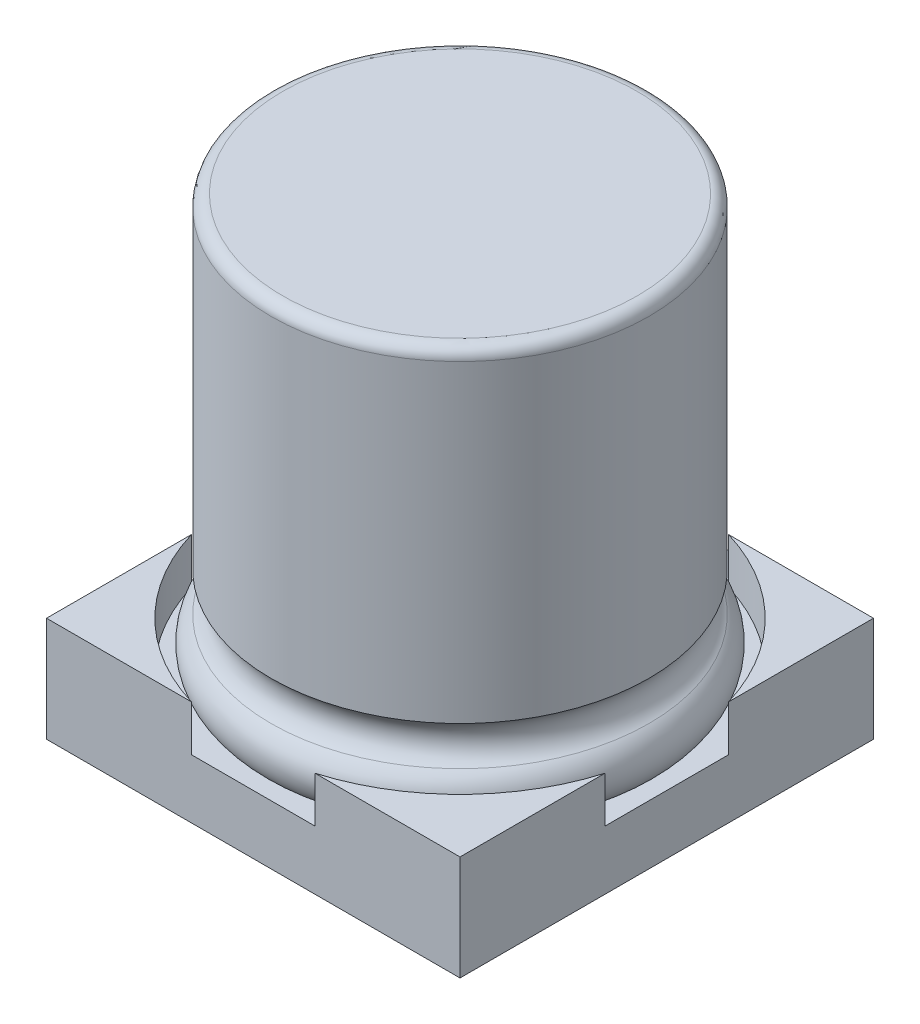
ISO-10303-21;
HEADER;
FILE_DESCRIPTION(('STEP AP214'),'2;1');
FILE_NAME('part.step','',(''),(''),'','','');
FILE_SCHEMA(('AUTOMOTIVE_DESIGN { 1 0 10303 214 1 1 1 1 }'));
ENDSEC;
DATA;
#1=APPLICATION_CONTEXT('core data for automotive mechanical design processes');
#2=APPLICATION_PROTOCOL_DEFINITION('international standard','automotive_design',2000,#1);
#3=PRODUCT_CONTEXT('',#1,'mechanical');
#4=PRODUCT('Part','Part','',(#3));
#5=PRODUCT_RELATED_PRODUCT_CATEGORY('part','',(#4));
#6=PRODUCT_DEFINITION_FORMATION('','',#4);
#7=PRODUCT_DEFINITION_CONTEXT('part definition',#1,'design');
#8=PRODUCT_DEFINITION('design','',#6,#7);
#9=PRODUCT_DEFINITION_SHAPE('','',#8);
#10=(LENGTH_UNIT() NAMED_UNIT(*) SI_UNIT(.MILLI.,.METRE.));
#11=(NAMED_UNIT(*) PLANE_ANGLE_UNIT() SI_UNIT($,.RADIAN.));
#12=(NAMED_UNIT(*) SI_UNIT($,.STERADIAN.) SOLID_ANGLE_UNIT());
#13=UNCERTAINTY_MEASURE_WITH_UNIT(LENGTH_MEASURE(1.E-05),#10,'distance_accuracy_value','');
#14=(GEOMETRIC_REPRESENTATION_CONTEXT(3) GLOBAL_UNCERTAINTY_ASSIGNED_CONTEXT((#13)) GLOBAL_UNIT_ASSIGNED_CONTEXT((#10,
#11,#12)) REPRESENTATION_CONTEXT('',''));
#15=CARTESIAN_POINT('',(0.,0.,0.));
#16=DIRECTION('',(0.,0.,1.));
#17=DIRECTION('',(1.,0.,0.));
#18=AXIS2_PLACEMENT_3D('',#15,#16,#17);
#19=CARTESIAN_POINT('',(0.,0.2,-4.6380085368));
#20=DIRECTION('',(0.,0.,-1.));
#21=DIRECTION('',(-1.,0.,0.));
#22=AXIS2_PLACEMENT_3D('',#19,#20,#21);
#23=PLANE('',#22);
#24=DIRECTION('',(1.,0.,0.));
#25=VECTOR('',#24,1.);
#26=CARTESIAN_POINT('',(-0.6,0.4,-4.6380085368));
#27=LINE('',#26,#25);
#28=CARTESIAN_POINT('',(0.6,0.4,-4.6380085368));
#29=VERTEX_POINT('',#28);
#30=CARTESIAN_POINT('',(-0.6,0.4,-4.6380085368));
#31=VERTEX_POINT('',#30);
#32=EDGE_CURVE('E129',#29,#31,#27,.F.);
#33=ORIENTED_EDGE('',*,*,#32,.F.);
#34=DIRECTION('',(0.,1.,0.));
#35=VECTOR('',#34,1.);
#36=CARTESIAN_POINT('',(0.6,0.4,-4.6380085368));
#37=LINE('',#36,#35);
#38=CARTESIAN_POINT('',(0.6,0.,-4.6380085368));
#39=VERTEX_POINT('',#38);
#40=EDGE_CURVE('E136',#39,#29,#37,.T.);
#41=ORIENTED_EDGE('',*,*,#40,.F.);
#42=DIRECTION('',(1.,0.,0.));
#43=VECTOR('',#42,1.);
#44=CARTESIAN_POINT('',(0.,0.,-4.6380085368));
#45=LINE('',#44,#43);
#46=CARTESIAN_POINT('',(-0.6,0.,-4.6380085368));
#47=VERTEX_POINT('',#46);
#48=EDGE_CURVE('E132',#39,#47,#45,.F.);
#49=ORIENTED_EDGE('',*,*,#48,.T.);
#50=DIRECTION('',(0.,1.,0.));
#51=VECTOR('',#50,1.);
#52=CARTESIAN_POINT('',(-0.6,0.,-4.6380085368));
#53=LINE('',#52,#51);
#54=EDGE_CURVE('E126',#31,#47,#53,.F.);
#55=ORIENTED_EDGE('',*,*,#54,.F.);
#56=EDGE_LOOP('',(#33,#41,#49,#55));
#57=FACE_BOUND('',#56,.T.);
#58=ADVANCED_FACE('F17',(#57),#23,.T.);
#59=CARTESIAN_POINT('',(-0.6,0.,-3.5));
#60=DIRECTION('',(-1.,0.,0.));
#61=DIRECTION('',(0.,0.,1.));
#62=AXIS2_PLACEMENT_3D('',#59,#60,#61);
#63=PLANE('',#62);
#64=ORIENTED_EDGE('',*,*,#54,.T.);
#65=DIRECTION('',(0.,0.,1.));
#66=VECTOR('',#65,1.);
#67=CARTESIAN_POINT('',(-0.6,0.,0.));
#68=LINE('',#67,#66);
#69=CARTESIAN_POINT('',(-0.6,0.,-3.5));
#70=VERTEX_POINT('',#69);
#71=EDGE_CURVE('E210',#47,#70,#68,.T.);
#72=ORIENTED_EDGE('',*,*,#71,.T.);
#73=DIRECTION('',(0.,1.,0.));
#74=VECTOR('',#73,1.);
#75=CARTESIAN_POINT('',(-0.6,0.,-3.5));
#76=LINE('',#75,#74);
#77=CARTESIAN_POINT('',(-0.6,0.4,-3.5));
#78=VERTEX_POINT('',#77);
#79=EDGE_CURVE('E142',#78,#70,#76,.F.);
#80=ORIENTED_EDGE('',*,*,#79,.F.);
#81=DIRECTION('',(0.,0.,1.));
#82=VECTOR('',#81,1.);
#83=CARTESIAN_POINT('',(-0.6,0.4,-3.5));
#84=LINE('',#83,#82);
#85=EDGE_CURVE('E139',#31,#78,#84,.T.);
#86=ORIENTED_EDGE('',*,*,#85,.F.);
#87=EDGE_LOOP('',(#64,#72,#80,#86));
#88=FACE_BOUND('',#87,.T.);
#89=ADVANCED_FACE('F140',(#88),#63,.T.);
#90=CARTESIAN_POINT('',(0.6,0.4,-3.5));
#91=DIRECTION('',(1.,0.,0.));
#92=DIRECTION('',(0.,0.,-1.));
#93=AXIS2_PLACEMENT_3D('',#90,#91,#92);
#94=PLANE('',#93);
#95=ORIENTED_EDGE('',*,*,#40,.T.);
#96=DIRECTION('',(0.,0.,1.));
#97=VECTOR('',#96,1.);
#98=CARTESIAN_POINT('',(0.6,0.4,-3.5));
#99=LINE('',#98,#97);
#100=CARTESIAN_POINT('',(0.6,0.4,-3.5));
#101=VERTEX_POINT('',#100);
#102=EDGE_CURVE('E149',#101,#29,#99,.F.);
#103=ORIENTED_EDGE('',*,*,#102,.F.);
#104=DIRECTION('',(0.,1.,0.));
#105=VECTOR('',#104,1.);
#106=CARTESIAN_POINT('',(0.6,0.,-3.5));
#107=LINE('',#106,#105);
#108=CARTESIAN_POINT('',(0.6,0.,-3.5));
#109=VERTEX_POINT('',#108);
#110=EDGE_CURVE('E196',#109,#101,#107,.T.);
#111=ORIENTED_EDGE('',*,*,#110,.F.);
#112=DIRECTION('',(0.,0.,1.));
#113=VECTOR('',#112,1.);
#114=CARTESIAN_POINT('',(0.6,0.,0.));
#115=LINE('',#114,#113);
#116=EDGE_CURVE('E211',#109,#39,#115,.F.);
#117=ORIENTED_EDGE('',*,*,#116,.T.);
#118=EDGE_LOOP('',(#95,#103,#111,#117));
#119=FACE_BOUND('',#118,.T.);
#120=ADVANCED_FACE('F215',(#119),#94,.T.);
#121=CARTESIAN_POINT('',(-0.6,0.4,-3.5));
#122=DIRECTION('',(0.,1.,0.));
#123=DIRECTION('',(0.,0.,1.));
#124=AXIS2_PLACEMENT_3D('',#121,#122,#123);
#125=PLANE('',#124);
#126=ORIENTED_EDGE('',*,*,#32,.T.);
#127=ORIENTED_EDGE('',*,*,#85,.T.);
#128=DIRECTION('',(-1.,0.,0.));
#129=VECTOR('',#128,1.);
#130=CARTESIAN_POINT('',(3.5,0.4,-3.5));
#131=LINE('',#130,#129);
#132=EDGE_CURVE('E190',#101,#78,#131,.T.);
#133=ORIENTED_EDGE('',*,*,#132,.F.);
#134=ORIENTED_EDGE('',*,*,#102,.T.);
#135=EDGE_LOOP('',(#126,#127,#133,#134));
#136=FACE_BOUND('',#135,.T.);
#137=ADVANCED_FACE('F148',(#136),#125,.T.);
#138=CARTESIAN_POINT('',(-2.27357437807846,1.775,-2.27357437807846));
#139=DIRECTION('',(0.,1.,0.));
#140=DIRECTION('',(0.,0.,1.));
#141=AXIS2_PLACEMENT_3D('',#138,#139,#140);
#142=PLANE('',#141);
#143=DIRECTION('',(0.,0.,1.));
#144=VECTOR('',#143,1.);
#145=CARTESIAN_POINT('',(-3.5,1.775,-2.27357437807846));
#146=LINE('',#145,#144);
#147=CARTESIAN_POINT('',(-3.5,1.775,-2.268));
#148=VERTEX_POINT('',#147);
#149=CARTESIAN_POINT('',(-3.5,1.775,-1.04714875615693));
#150=VERTEX_POINT('',#149);
#151=EDGE_CURVE('E146',#148,#150,#146,.T.);
#152=ORIENTED_EDGE('',*,*,#151,.T.);
#153=CARTESIAN_POINT('',(0.,1.775,0.));
#154=DIRECTION('',(0.,1.,0.));
#155=DIRECTION('',(0.,0.,1.));
#156=AXIS2_PLACEMENT_3D('',#153,#154,#155);
#157=CIRCLE('',#156,3.653289);
#158=CARTESIAN_POINT('',(-1.04714875615693,1.775,-3.5));
#159=VERTEX_POINT('',#158);
#160=EDGE_CURVE('E188',#150,#159,#157,.F.);
#161=ORIENTED_EDGE('',*,*,#160,.T.);
#162=DIRECTION('',(-1.,0.,0.));
#163=VECTOR('',#162,1.);
#164=CARTESIAN_POINT('',(3.5,1.775,-3.5));
#165=LINE('',#164,#163);
#166=CARTESIAN_POINT('',(-2.268,1.775,-3.5));
#167=VERTEX_POINT('',#166);
#168=EDGE_CURVE('E315',#167,#159,#165,.F.);
#169=ORIENTED_EDGE('',*,*,#168,.F.);
#170=DIRECTION('',(-0.707106781186547,0.,0.707106781186548));
#171=VECTOR('',#170,1.);
#172=CARTESIAN_POINT('',(-2.884,1.775,-2.884));
#173=LINE('',#172,#171);
#174=EDGE_CURVE('E99',#148,#167,#173,.F.);
#175=ORIENTED_EDGE('',*,*,#174,.F.);
#176=EDGE_LOOP('',(#152,#161,#169,#175));
#177=FACE_BOUND('',#176,.T.);
#178=ADVANCED_FACE('F341',(#177),#142,.T.);
#179=CARTESIAN_POINT('',(-2.884,0.,-2.884));
#180=DIRECTION('',(-0.707106781186548,0.,-0.707106781186547));
#181=DIRECTION('',(-0.707106781186547,0.,0.707106781186548));
#182=AXIS2_PLACEMENT_3D('',#179,#180,#181);
#183=PLANE('',#182);
#184=DIRECTION('',(0.,1.,0.));
#185=VECTOR('',#184,1.);
#186=CARTESIAN_POINT('',(-3.5,0.,-2.268));
#187=LINE('',#186,#185);
#188=CARTESIAN_POINT('',(-3.5,0.,-2.268));
#189=VERTEX_POINT('',#188);
#190=EDGE_CURVE('E194',#148,#189,#187,.F.);
#191=ORIENTED_EDGE('',*,*,#190,.F.);
#192=ORIENTED_EDGE('',*,*,#174,.T.);
#193=DIRECTION('',(0.,1.,0.));
#194=VECTOR('',#193,1.);
#195=CARTESIAN_POINT('',(-2.268,0.,-3.5));
#196=LINE('',#195,#194);
#197=CARTESIAN_POINT('',(-2.268,0.,-3.5));
#198=VERTEX_POINT('',#197);
#199=EDGE_CURVE('E237',#198,#167,#196,.T.);
#200=ORIENTED_EDGE('',*,*,#199,.F.);
#201=DIRECTION('',(-0.707106781186547,0.,0.707106781186547));
#202=VECTOR('',#201,1.);
#203=CARTESIAN_POINT('',(-2.268,0.,-3.5));
#204=LINE('',#203,#202);
#205=EDGE_CURVE('E225',#198,#189,#204,.T.);
#206=ORIENTED_EDGE('',*,*,#205,.T.);
#207=EDGE_LOOP('',(#191,#192,#200,#206));
#208=FACE_BOUND('',#207,.T.);
#209=ADVANCED_FACE('F331',(#208),#183,.T.);
#210=CARTESIAN_POINT('',(-2.27357437807847,1.775,2.27357437807846));
#211=DIRECTION('',(0.,1.,0.));
#212=DIRECTION('',(0.,0.,1.));
#213=AXIS2_PLACEMENT_3D('',#210,#211,#212);
#214=PLANE('',#213);
#215=DIRECTION('',(1.,0.,0.));
#216=VECTOR('',#215,1.);
#217=CARTESIAN_POINT('',(-3.5,1.775,3.5));
#218=LINE('',#217,#216);
#219=CARTESIAN_POINT('',(-1.04714875615693,1.775,3.5));
#220=VERTEX_POINT('',#219);
#221=CARTESIAN_POINT('',(-3.5,1.775,3.5));
#222=VERTEX_POINT('',#221);
#223=EDGE_CURVE('E286',#220,#222,#218,.F.);
#224=ORIENTED_EDGE('',*,*,#223,.F.);
#225=CARTESIAN_POINT('',(0.,1.775,0.));
#226=DIRECTION('',(0.,1.,0.));
#227=DIRECTION('',(0.,0.,1.));
#228=AXIS2_PLACEMENT_3D('',#225,#226,#227);
#229=CIRCLE('',#228,3.653289);
#230=CARTESIAN_POINT('',(-3.5,1.775,1.04714875615693));
#231=VERTEX_POINT('',#230);
#232=EDGE_CURVE('E185',#220,#231,#229,.F.);
#233=ORIENTED_EDGE('',*,*,#232,.T.);
#234=DIRECTION('',(0.,0.,1.));
#235=VECTOR('',#234,1.);
#236=CARTESIAN_POINT('',(-3.5,1.775,-3.5));
#237=LINE('',#236,#235);
#238=EDGE_CURVE('E296',#222,#231,#237,.F.);
#239=ORIENTED_EDGE('',*,*,#238,.F.);
#240=EDGE_LOOP('',(#224,#233,#239));
#241=FACE_BOUND('',#240,.T.);
#242=ADVANCED_FACE('F349',(#241),#214,.T.);
#243=CARTESIAN_POINT('',(0.,0.,0.));
#244=DIRECTION('',(0.,1.,0.));
#245=DIRECTION('',(0.,0.,1.));
#246=AXIS2_PLACEMENT_3D('',#243,#244,#245);
#247=PLANE('',#246);
#248=DIRECTION('',(-1.,0.,0.));
#249=VECTOR('',#248,1.);
#250=CARTESIAN_POINT('',(3.5,0.,-3.5));
#251=LINE('',#250,#249);
#252=EDGE_CURVE('E224',#70,#198,#251,.T.);
#253=ORIENTED_EDGE('',*,*,#252,.F.);
#254=ORIENTED_EDGE('',*,*,#71,.F.);
#255=ORIENTED_EDGE('',*,*,#48,.F.);
#256=ORIENTED_EDGE('',*,*,#116,.F.);
#257=DIRECTION('',(-1.,0.,0.));
#258=VECTOR('',#257,1.);
#259=CARTESIAN_POINT('',(3.5,0.,-3.5));
#260=LINE('',#259,#258);
#261=CARTESIAN_POINT('',(3.5,0.,-3.5));
#262=VERTEX_POINT('',#261);
#263=EDGE_CURVE('E200',#262,#109,#260,.T.);
#264=ORIENTED_EDGE('',*,*,#263,.F.);
#265=DIRECTION('',(0.,0.,-1.));
#266=VECTOR('',#265,1.);
#267=CARTESIAN_POINT('',(3.5,0.,3.5));
#268=LINE('',#267,#266);
#269=CARTESIAN_POINT('',(3.5,0.,3.5));
#270=VERTEX_POINT('',#269);
#271=EDGE_CURVE('E260',#270,#262,#268,.T.);
#272=ORIENTED_EDGE('',*,*,#271,.F.);
#273=DIRECTION('',(1.,0.,0.));
#274=VECTOR('',#273,1.);
#275=CARTESIAN_POINT('',(-3.5,0.,3.5));
#276=LINE('',#275,#274);
#277=CARTESIAN_POINT('',(-3.5,0.,3.5));
#278=VERTEX_POINT('',#277);
#279=EDGE_CURVE('E280',#278,#270,#276,.T.);
#280=ORIENTED_EDGE('',*,*,#279,.F.);
#281=DIRECTION('',(0.,0.,1.));
#282=VECTOR('',#281,1.);
#283=CARTESIAN_POINT('',(-3.5,0.,-3.5));
#284=LINE('',#283,#282);
#285=EDGE_CURVE('E299',#189,#278,#284,.T.);
#286=ORIENTED_EDGE('',*,*,#285,.F.);
#287=ORIENTED_EDGE('',*,*,#205,.F.);
#288=EDGE_LOOP('',(#253,#254,#255,#256,#264,#272,#280,#286,#287));
#289=FACE_BOUND('',#288,.T.);
#290=ADVANCED_FACE('F222',(#289),#247,.F.);
#291=CARTESIAN_POINT('',(2.27357437807847,1.775,-2.27357437807847));
#292=DIRECTION('',(0.,1.,0.));
#293=DIRECTION('',(0.,0.,1.));
#294=AXIS2_PLACEMENT_3D('',#291,#292,#293);
#295=PLANE('',#294);
#296=DIRECTION('',(-1.,0.,0.));
#297=VECTOR('',#296,1.);
#298=CARTESIAN_POINT('',(3.5,1.775,-3.5));
#299=LINE('',#298,#297);
#300=CARTESIAN_POINT('',(1.04714875615693,1.775,-3.5));
#301=VERTEX_POINT('',#300);
#302=CARTESIAN_POINT('',(3.5,1.775,-3.5));
#303=VERTEX_POINT('',#302);
#304=EDGE_CURVE('E246',#301,#303,#299,.F.);
#305=ORIENTED_EDGE('',*,*,#304,.F.);
#306=CARTESIAN_POINT('',(0.,1.775,0.));
#307=DIRECTION('',(0.,1.,0.));
#308=DIRECTION('',(0.,0.,1.));
#309=AXIS2_PLACEMENT_3D('',#306,#307,#308);
#310=CIRCLE('',#309,3.653289);
#311=CARTESIAN_POINT('',(3.5,1.775,-1.04714875615693));
#312=VERTEX_POINT('',#311);
#313=EDGE_CURVE('E20',#301,#312,#310,.F.);
#314=ORIENTED_EDGE('',*,*,#313,.T.);
#315=DIRECTION('',(0.,0.,-1.));
#316=VECTOR('',#315,1.);
#317=CARTESIAN_POINT('',(3.5,1.775,3.5));
#318=LINE('',#317,#316);
#319=EDGE_CURVE('E243',#303,#312,#318,.F.);
#320=ORIENTED_EDGE('',*,*,#319,.F.);
#321=EDGE_LOOP('',(#305,#314,#320));
#322=FACE_BOUND('',#321,.T.);
#323=ADVANCED_FACE('F240',(#322),#295,.T.);
#324=CARTESIAN_POINT('',(2.27357437807847,1.775,2.27357437807847));
#325=DIRECTION('',(0.,1.,0.));
#326=DIRECTION('',(0.,0.,1.));
#327=AXIS2_PLACEMENT_3D('',#324,#325,#326);
#328=PLANE('',#327);
#329=DIRECTION('',(0.,0.,-1.));
#330=VECTOR('',#329,1.);
#331=CARTESIAN_POINT('',(3.5,1.775,3.5));
#332=LINE('',#331,#330);
#333=CARTESIAN_POINT('',(3.5,1.775,1.04714875615693));
#334=VERTEX_POINT('',#333);
#335=CARTESIAN_POINT('',(3.5,1.775,3.5));
#336=VERTEX_POINT('',#335);
#337=EDGE_CURVE('E421',#334,#336,#332,.F.);
#338=ORIENTED_EDGE('',*,*,#337,.F.);
#339=CARTESIAN_POINT('',(0.,1.775,0.));
#340=DIRECTION('',(0.,1.,0.));
#341=DIRECTION('',(0.,0.,1.));
#342=AXIS2_PLACEMENT_3D('',#339,#340,#341);
#343=CIRCLE('',#342,3.653289);
#344=CARTESIAN_POINT('',(1.04714875615693,1.775,3.5));
#345=VERTEX_POINT('',#344);
#346=EDGE_CURVE('E181',#334,#345,#343,.F.);
#347=ORIENTED_EDGE('',*,*,#346,.T.);
#348=DIRECTION('',(1.,0.,0.));
#349=VECTOR('',#348,1.);
#350=CARTESIAN_POINT('',(-3.5,1.775,3.5));
#351=LINE('',#350,#349);
#352=EDGE_CURVE('E283',#336,#345,#351,.F.);
#353=ORIENTED_EDGE('',*,*,#352,.F.);
#354=EDGE_LOOP('',(#338,#347,#353));
#355=FACE_BOUND('',#354,.T.);
#356=ADVANCED_FACE('F462',(#355),#328,.T.);
#357=CARTESIAN_POINT('',(0.,1.,0.));
#358=DIRECTION('',(0.,1.,0.));
#359=DIRECTION('',(0.,0.,1.));
#360=AXIS2_PLACEMENT_3D('',#357,#358,#359);
#361=CYLINDRICAL_SURFACE('',#360,3.653289);
#362=DIRECTION('',(0.,1.,0.));
#363=VECTOR('',#362,1.);
#364=CARTESIAN_POINT('',(3.5,0.,-1.04714875615693));
#365=LINE('',#364,#363);
#366=CARTESIAN_POINT('',(3.5,1.,-1.04714875615693));
#367=VERTEX_POINT('',#366);
#368=EDGE_CURVE('E249',#312,#367,#365,.F.);
#369=ORIENTED_EDGE('',*,*,#368,.F.);
#370=ORIENTED_EDGE('',*,*,#313,.F.);
#371=DIRECTION('',(0.,1.,0.));
#372=VECTOR('',#371,1.);
#373=CARTESIAN_POINT('',(1.04714875615693,0.,-3.5));
#374=LINE('',#373,#372);
#375=CARTESIAN_POINT('',(1.04714875615693,1.,-3.5));
#376=VERTEX_POINT('',#375);
#377=EDGE_CURVE('E271',#376,#301,#374,.T.);
#378=ORIENTED_EDGE('',*,*,#377,.F.);
#379=CARTESIAN_POINT('',(0.,1.,0.));
#380=DIRECTION('',(0.,1.,0.));
#381=DIRECTION('',(0.,0.,1.));
#382=AXIS2_PLACEMENT_3D('',#379,#380,#381);
#383=CIRCLE('',#382,3.653289);
#384=EDGE_CURVE('E177',#367,#376,#383,.T.);
#385=ORIENTED_EDGE('',*,*,#384,.F.);
#386=EDGE_LOOP('',(#369,#370,#378,#385));
#387=FACE_BOUND('',#386,.T.);
#388=ADVANCED_FACE('F250',(#387),#361,.F.);
#389=CARTESIAN_POINT('',(3.5,0.,-3.5));
#390=DIRECTION('',(0.,0.,-1.));
#391=DIRECTION('',(-1.,0.,0.));
#392=AXIS2_PLACEMENT_3D('',#389,#390,#391);
#393=PLANE('',#392);
#394=ORIENTED_EDGE('',*,*,#110,.T.);
#395=ORIENTED_EDGE('',*,*,#132,.T.);
#396=ORIENTED_EDGE('',*,*,#79,.T.);
#397=ORIENTED_EDGE('',*,*,#252,.T.);
#398=ORIENTED_EDGE('',*,*,#199,.T.);
#399=ORIENTED_EDGE('',*,*,#168,.T.);
#400=DIRECTION('',(0.,1.,0.));
#401=VECTOR('',#400,1.);
#402=CARTESIAN_POINT('',(-1.04714875615693,1.,-3.5));
#403=LINE('',#402,#401);
#404=CARTESIAN_POINT('',(-1.04714875615693,1.,-3.5));
#405=VERTEX_POINT('',#404);
#406=EDGE_CURVE('E189',#159,#405,#403,.F.);
#407=ORIENTED_EDGE('',*,*,#406,.T.);
#408=DIRECTION('',(1.,0.,0.));
#409=VECTOR('',#408,1.);
#410=CARTESIAN_POINT('',(0.,1.,-3.5));
#411=LINE('',#410,#409);
#412=EDGE_CURVE('E176',#376,#405,#411,.F.);
#413=ORIENTED_EDGE('',*,*,#412,.F.);
#414=ORIENTED_EDGE('',*,*,#377,.T.);
#415=ORIENTED_EDGE('',*,*,#304,.T.);
#416=DIRECTION('',(0.,1.,0.));
#417=VECTOR('',#416,1.);
#418=CARTESIAN_POINT('',(3.5,0.,-3.5));
#419=LINE('',#418,#417);
#420=EDGE_CURVE('E258',#262,#303,#419,.T.);
#421=ORIENTED_EDGE('',*,*,#420,.F.);
#422=ORIENTED_EDGE('',*,*,#263,.T.);
#423=EDGE_LOOP('',(#394,#395,#396,#397,#398,#399,#407,#413,#414,#415,#421,#422));
#424=FACE_BOUND('',#423,.T.);
#425=ADVANCED_FACE('F329',(#424),#393,.T.);
#426=CARTESIAN_POINT('',(0.,1.,0.));
#427=DIRECTION('',(0.,1.,0.));
#428=DIRECTION('',(0.,0.,1.));
#429=AXIS2_PLACEMENT_3D('',#426,#427,#428);
#430=CYLINDRICAL_SURFACE('',#429,3.653289);
#431=ORIENTED_EDGE('',*,*,#406,.F.);
#432=ORIENTED_EDGE('',*,*,#160,.F.);
#433=DIRECTION('',(0.,1.,0.));
#434=VECTOR('',#433,1.);
#435=CARTESIAN_POINT('',(-3.5,0.,-1.04714875615693));
#436=LINE('',#435,#434);
#437=CARTESIAN_POINT('',(-3.5,1.,-1.04714875615693));
#438=VERTEX_POINT('',#437);
#439=EDGE_CURVE('E187',#438,#150,#436,.T.);
#440=ORIENTED_EDGE('',*,*,#439,.F.);
#441=CARTESIAN_POINT('',(0.,1.,0.));
#442=DIRECTION('',(0.,1.,0.));
#443=DIRECTION('',(0.,0.,1.));
#444=AXIS2_PLACEMENT_3D('',#441,#442,#443);
#445=CIRCLE('',#444,3.653289);
#446=EDGE_CURVE('E173',#405,#438,#445,.T.);
#447=ORIENTED_EDGE('',*,*,#446,.F.);
#448=EDGE_LOOP('',(#431,#432,#440,#447));
#449=FACE_BOUND('',#448,.T.);
#450=ADVANCED_FACE('F514',(#449),#430,.F.);
#451=CARTESIAN_POINT('',(-3.5,0.,-3.5));
#452=DIRECTION('',(-1.,0.,0.));
#453=DIRECTION('',(0.,0.,1.));
#454=AXIS2_PLACEMENT_3D('',#451,#452,#453);
#455=PLANE('',#454);
#456=ORIENTED_EDGE('',*,*,#439,.T.);
#457=ORIENTED_EDGE('',*,*,#151,.F.);
#458=ORIENTED_EDGE('',*,*,#190,.T.);
#459=ORIENTED_EDGE('',*,*,#285,.T.);
#460=DIRECTION('',(0.,1.,0.));
#461=VECTOR('',#460,1.);
#462=CARTESIAN_POINT('',(-3.5,0.,3.5));
#463=LINE('',#462,#461);
#464=EDGE_CURVE('E184',#222,#278,#463,.F.);
#465=ORIENTED_EDGE('',*,*,#464,.F.);
#466=ORIENTED_EDGE('',*,*,#238,.T.);
#467=DIRECTION('',(0.,1.,0.));
#468=VECTOR('',#467,1.);
#469=CARTESIAN_POINT('',(-3.5,1.,1.04714875615693));
#470=LINE('',#469,#468);
#471=CARTESIAN_POINT('',(-3.5,1.,1.04714875615693));
#472=VERTEX_POINT('',#471);
#473=EDGE_CURVE('E186',#231,#472,#470,.F.);
#474=ORIENTED_EDGE('',*,*,#473,.T.);
#475=DIRECTION('',(0.,0.,1.));
#476=VECTOR('',#475,1.);
#477=CARTESIAN_POINT('',(-3.5,1.,0.));
#478=LINE('',#477,#476);
#479=EDGE_CURVE('E172',#438,#472,#478,.T.);
#480=ORIENTED_EDGE('',*,*,#479,.F.);
#481=EDGE_LOOP('',(#456,#457,#458,#459,#465,#466,#474,#480));
#482=FACE_BOUND('',#481,.T.);
#483=ADVANCED_FACE('F339',(#482),#455,.T.);
#484=CARTESIAN_POINT('',(0.,1.,0.));
#485=DIRECTION('',(0.,1.,0.));
#486=DIRECTION('',(0.,0.,1.));
#487=AXIS2_PLACEMENT_3D('',#484,#485,#486);
#488=CYLINDRICAL_SURFACE('',#487,3.653289);
#489=ORIENTED_EDGE('',*,*,#473,.F.);
#490=ORIENTED_EDGE('',*,*,#232,.F.);
#491=DIRECTION('',(0.,1.,0.));
#492=VECTOR('',#491,1.);
#493=CARTESIAN_POINT('',(-1.04714875615693,0.,3.5));
#494=LINE('',#493,#492);
#495=CARTESIAN_POINT('',(-1.04714875615693,1.,3.5));
#496=VERTEX_POINT('',#495);
#497=EDGE_CURVE('E289',#496,#220,#494,.T.);
#498=ORIENTED_EDGE('',*,*,#497,.F.);
#499=CARTESIAN_POINT('',(0.,1.,0.));
#500=DIRECTION('',(0.,1.,0.));
#501=DIRECTION('',(0.,0.,1.));
#502=AXIS2_PLACEMENT_3D('',#499,#500,#501);
#503=CIRCLE('',#502,3.653289);
#504=EDGE_CURVE('E169',#472,#496,#503,.T.);
#505=ORIENTED_EDGE('',*,*,#504,.F.);
#506=EDGE_LOOP('',(#489,#490,#498,#505));
#507=FACE_BOUND('',#506,.T.);
#508=ADVANCED_FACE('F450',(#507),#488,.F.);
#509=CARTESIAN_POINT('',(-3.5,0.,3.5));
#510=DIRECTION('',(0.,0.,1.));
#511=DIRECTION('',(1.,0.,0.));
#512=AXIS2_PLACEMENT_3D('',#509,#510,#511);
#513=PLANE('',#512);
#514=ORIENTED_EDGE('',*,*,#223,.T.);
#515=ORIENTED_EDGE('',*,*,#464,.T.);
#516=ORIENTED_EDGE('',*,*,#279,.T.);
#517=DIRECTION('',(0.,1.,0.));
#518=VECTOR('',#517,1.);
#519=CARTESIAN_POINT('',(3.5,0.,3.5));
#520=LINE('',#519,#518);
#521=EDGE_CURVE('E180',#336,#270,#520,.F.);
#522=ORIENTED_EDGE('',*,*,#521,.F.);
#523=ORIENTED_EDGE('',*,*,#352,.T.);
#524=DIRECTION('',(0.,1.,0.));
#525=VECTOR('',#524,1.);
#526=CARTESIAN_POINT('',(1.04714875615693,1.,3.5));
#527=LINE('',#526,#525);
#528=CARTESIAN_POINT('',(1.04714875615693,1.,3.5));
#529=VERTEX_POINT('',#528);
#530=EDGE_CURVE('E183',#345,#529,#527,.F.);
#531=ORIENTED_EDGE('',*,*,#530,.T.);
#532=DIRECTION('',(1.,0.,0.));
#533=VECTOR('',#532,1.);
#534=CARTESIAN_POINT('',(0.,1.,3.5));
#535=LINE('',#534,#533);
#536=EDGE_CURVE('E168',#496,#529,#535,.T.);
#537=ORIENTED_EDGE('',*,*,#536,.F.);
#538=ORIENTED_EDGE('',*,*,#497,.T.);
#539=EDGE_LOOP('',(#514,#515,#516,#522,#523,#531,#537,#538));
#540=FACE_BOUND('',#539,.T.);
#541=ADVANCED_FACE('F440',(#540),#513,.T.);
#542=CARTESIAN_POINT('',(0.,1.,0.));
#543=DIRECTION('',(0.,1.,0.));
#544=DIRECTION('',(0.,0.,1.));
#545=AXIS2_PLACEMENT_3D('',#542,#543,#544);
#546=CYLINDRICAL_SURFACE('',#545,3.653289);
#547=ORIENTED_EDGE('',*,*,#530,.F.);
#548=ORIENTED_EDGE('',*,*,#346,.F.);
#549=DIRECTION('',(0.,1.,0.));
#550=VECTOR('',#549,1.);
#551=CARTESIAN_POINT('',(3.5,0.,1.04714875615693));
#552=LINE('',#551,#550);
#553=CARTESIAN_POINT('',(3.5,1.,1.04714875615693));
#554=VERTEX_POINT('',#553);
#555=EDGE_CURVE('E35',#554,#334,#552,.T.);
#556=ORIENTED_EDGE('',*,*,#555,.F.);
#557=CARTESIAN_POINT('',(0.,1.,0.));
#558=DIRECTION('',(0.,1.,0.));
#559=DIRECTION('',(0.,0.,1.));
#560=AXIS2_PLACEMENT_3D('',#557,#558,#559);
#561=CIRCLE('',#560,3.653289);
#562=EDGE_CURVE('E165',#529,#554,#561,.T.);
#563=ORIENTED_EDGE('',*,*,#562,.F.);
#564=EDGE_LOOP('',(#547,#548,#556,#563));
#565=FACE_BOUND('',#564,.T.);
#566=ADVANCED_FACE('F444',(#565),#546,.F.);
#567=CARTESIAN_POINT('',(3.5,0.,3.5));
#568=DIRECTION('',(1.,0.,0.));
#569=DIRECTION('',(0.,0.,-1.));
#570=AXIS2_PLACEMENT_3D('',#567,#568,#569);
#571=PLANE('',#570);
#572=ORIENTED_EDGE('',*,*,#337,.T.);
#573=ORIENTED_EDGE('',*,*,#521,.T.);
#574=ORIENTED_EDGE('',*,*,#271,.T.);
#575=ORIENTED_EDGE('',*,*,#420,.T.);
#576=ORIENTED_EDGE('',*,*,#319,.T.);
#577=ORIENTED_EDGE('',*,*,#368,.T.);
#578=DIRECTION('',(0.,0.,1.));
#579=VECTOR('',#578,1.);
#580=CARTESIAN_POINT('',(3.5,1.,0.));
#581=LINE('',#580,#579);
#582=EDGE_CURVE('E164',#554,#367,#581,.F.);
#583=ORIENTED_EDGE('',*,*,#582,.F.);
#584=ORIENTED_EDGE('',*,*,#555,.T.);
#585=EDGE_LOOP('',(#572,#573,#574,#575,#576,#577,#583,#584));
#586=FACE_BOUND('',#585,.T.);
#587=ADVANCED_FACE('F255',(#586),#571,.T.);
#588=CARTESIAN_POINT('',(0.,1.,0.));
#589=DIRECTION('',(0.,1.,0.));
#590=DIRECTION('',(0.,0.,1.));
#591=AXIS2_PLACEMENT_3D('',#588,#589,#590);
#592=PLANE('',#591);
#593=CARTESIAN_POINT('',(0.,0.999999999999999,0.));
#594=DIRECTION('',(0.,-1.,0.));
#595=DIRECTION('',(1.,0.,0.));
#596=AXIS2_PLACEMENT_3D('',#593,#594,#595);
#597=CIRCLE('',#596,3.20000000000001);
#598=CARTESIAN_POINT('',(3.20000000000001,0.999999999999998,0.));
#599=VERTEX_POINT('',#598);
#600=EDGE_CURVE('E160',#599,#599,#597,.F.);
#601=ORIENTED_EDGE('',*,*,#600,.F.);
#602=EDGE_LOOP('',(#601));
#603=FACE_BOUND('',#602,.T.);
#604=ORIENTED_EDGE('',*,*,#562,.T.);
#605=ORIENTED_EDGE('',*,*,#582,.T.);
#606=ORIENTED_EDGE('',*,*,#384,.T.);
#607=ORIENTED_EDGE('',*,*,#412,.T.);
#608=ORIENTED_EDGE('',*,*,#446,.T.);
#609=ORIENTED_EDGE('',*,*,#479,.T.);
#610=ORIENTED_EDGE('',*,*,#504,.T.);
#611=ORIENTED_EDGE('',*,*,#536,.T.);
#612=EDGE_LOOP('',(#604,#605,#606,#607,#608,#609,#610,#611));
#613=FACE_BOUND('',#612,.T.);
#614=ADVANCED_FACE('F392',(#603,#613),#592,.T.);
#615=CARTESIAN_POINT('',(3.,8.,0.));
#616=DIRECTION('',(0.,1.,0.));
#617=DIRECTION('',(-1.,0.,0.));
#618=AXIS2_PLACEMENT_3D('',#615,#616,#617);
#619=PLANE('',#618);
#620=CARTESIAN_POINT('',(0.,8.,0.));
#621=DIRECTION('',(0.,-1.,0.));
#622=DIRECTION('',(1.,0.,0.));
#623=AXIS2_PLACEMENT_3D('',#620,#621,#622);
#624=CIRCLE('',#623,3.);
#625=CARTESIAN_POINT('',(3.,8.,0.));
#626=VERTEX_POINT('',#625);
#627=EDGE_CURVE('E163',#626,#626,#624,.T.);
#628=ORIENTED_EDGE('',*,*,#627,.F.);
#629=EDGE_LOOP('',(#628));
#630=FACE_BOUND('',#629,.T.);
#631=ADVANCED_FACE('F387',(#630),#619,.T.);
#632=CARTESIAN_POINT('',(0.,1.41556817695327,0.));
#633=DIRECTION('',(0.,-1.,0.));
#634=DIRECTION('',(0.,0.,-1.));
#635=AXIS2_PLACEMENT_3D('',#632,#633,#634);
#636=TOROIDAL_SURFACE('',#635,2.87663642022782,0.526555708752026);
#637=ORIENTED_EDGE('',*,*,#600,.T.);
#638=EDGE_LOOP('',(#637));
#639=FACE_BOUND('',#638,.T.);
#640=CARTESIAN_POINT('',(0.,1.83113635390655,0.));
#641=DIRECTION('',(0.,-1.,0.));
#642=DIRECTION('',(0.,0.,-1.));
#643=AXIS2_PLACEMENT_3D('',#640,#641,#642);
#644=CIRCLE('',#643,3.2);
#645=CARTESIAN_POINT('',(0.,1.83113635390655,-3.2));
#646=VERTEX_POINT('',#645);
#647=EDGE_CURVE('E374',#646,#646,#644,.T.);
#648=ORIENTED_EDGE('',*,*,#647,.T.);
#649=EDGE_LOOP('',(#648));
#650=FACE_BOUND('',#649,.T.);
#651=ADVANCED_FACE('F384',(#639,#650),#636,.T.);
#652=CARTESIAN_POINT('',(0.,7.8,0.));
#653=DIRECTION('',(0.,-1.,0.));
#654=DIRECTION('',(0.,0.,-1.));
#655=AXIS2_PLACEMENT_3D('',#652,#653,#654);
#656=TOROIDAL_SURFACE('',#655,3.,0.2);
#657=CARTESIAN_POINT('',(0.,7.8,0.));
#658=DIRECTION('',(0.,-1.,0.));
#659=DIRECTION('',(1.,0.,0.));
#660=AXIS2_PLACEMENT_3D('',#657,#658,#659);
#661=CIRCLE('',#660,3.2);
#662=CARTESIAN_POINT('',(3.2,7.8,0.));
#663=VERTEX_POINT('',#662);
#664=EDGE_CURVE('E26',#663,#663,#661,.T.);
#665=ORIENTED_EDGE('',*,*,#664,.F.);
#666=EDGE_LOOP('',(#665));
#667=FACE_BOUND('',#666,.T.);
#668=ORIENTED_EDGE('',*,*,#627,.T.);
#669=EDGE_LOOP('',(#668));
#670=FACE_BOUND('',#669,.T.);
#671=ADVANCED_FACE('F360',(#667,#670),#656,.T.);
#672=CARTESIAN_POINT('',(0.,2.1620884566071,0.));
#673=DIRECTION('',(0.,-1.,0.));
#674=DIRECTION('',(0.,0.,-1.));
#675=AXIS2_PLACEMENT_3D('',#672,#673,#674);
#676=TOROIDAL_SURFACE('',#675,3.42497768365847,0.400180274909006);
#677=ORIENTED_EDGE('',*,*,#647,.F.);
#678=EDGE_LOOP('',(#677));
#679=FACE_BOUND('',#678,.T.);
#680=CARTESIAN_POINT('',(0.,2.49304055930765,0.));
#681=DIRECTION('',(0.,-1.,0.));
#682=DIRECTION('',(1.,0.,0.));
#683=AXIS2_PLACEMENT_3D('',#680,#681,#682);
#684=CIRCLE('',#683,3.2);
#685=CARTESIAN_POINT('',(3.2,2.49304055930765,0.));
#686=VERTEX_POINT('',#685);
#687=EDGE_CURVE('E11',#686,#686,#684,.F.);
#688=ORIENTED_EDGE('',*,*,#687,.F.);
#689=EDGE_LOOP('',(#688));
#690=FACE_BOUND('',#689,.T.);
#691=ADVANCED_FACE('F354',(#679,#690),#676,.F.);
#692=CARTESIAN_POINT('',(0.,5.14652027965383,0.));
#693=DIRECTION('',(0.,-1.,0.));
#694=DIRECTION('',(1.,0.,0.));
#695=AXIS2_PLACEMENT_3D('',#692,#693,#694);
#696=CYLINDRICAL_SURFACE('',#695,3.2);
#697=ORIENTED_EDGE('',*,*,#687,.T.);
#698=EDGE_LOOP('',(#697));
#699=FACE_BOUND('',#698,.T.);
#700=ORIENTED_EDGE('',*,*,#664,.T.);
#701=EDGE_LOOP('',(#700));
#702=FACE_BOUND('',#701,.T.);
#703=ADVANCED_FACE('F352',(#699,#702),#696,.T.);
#704=CLOSED_SHELL('',(#58,#89,#120,#137,#178,#209,#242,#290,#323,#356,#388,#425,#450,#483,#508,
#541,#566,#587,#614,#631,#651,#671,#691,#703));
#705=MANIFOLD_SOLID_BREP('B1',#704);
#706=ADVANCED_BREP_SHAPE_REPRESENTATION('',(#18,#705),#14);
#707=SHAPE_DEFINITION_REPRESENTATION(#9,#706);
ENDSEC;
END-ISO-10303-21;
